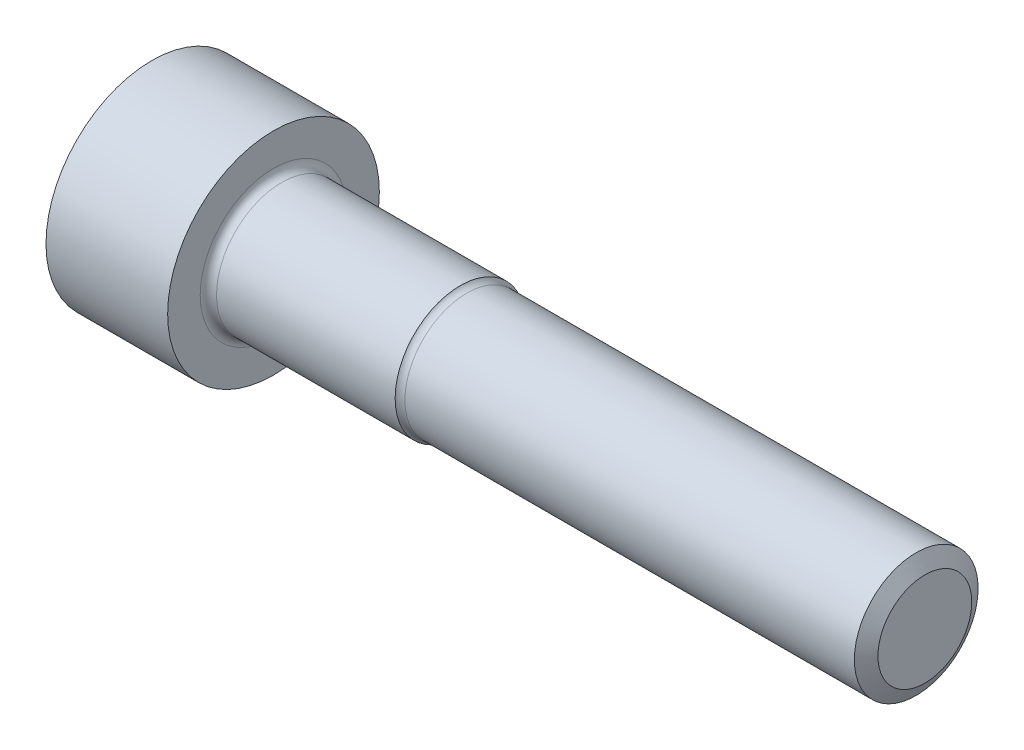
ISO-10303-21;
HEADER;
FILE_DESCRIPTION(('STEP AP214'),'2;1');
FILE_NAME('part.step','',(''),(''),'','','');
FILE_SCHEMA(('AUTOMOTIVE_DESIGN { 1 0 10303 214 1 1 1 1 }'));
ENDSEC;
DATA;
#1=APPLICATION_CONTEXT('core data for automotive mechanical design processes');
#2=APPLICATION_PROTOCOL_DEFINITION('international standard','automotive_design',2000,#1);
#3=PRODUCT_CONTEXT('',#1,'mechanical');
#4=PRODUCT('Part','Part','',(#3));
#5=PRODUCT_RELATED_PRODUCT_CATEGORY('part','',(#4));
#6=PRODUCT_DEFINITION_FORMATION('','',#4);
#7=PRODUCT_DEFINITION_CONTEXT('part definition',#1,'design');
#8=PRODUCT_DEFINITION('design','',#6,#7);
#9=PRODUCT_DEFINITION_SHAPE('','',#8);
#10=(LENGTH_UNIT() NAMED_UNIT(*) SI_UNIT(.MILLI.,.METRE.));
#11=(NAMED_UNIT(*) PLANE_ANGLE_UNIT() SI_UNIT($,.RADIAN.));
#12=(NAMED_UNIT(*) SI_UNIT($,.STERADIAN.) SOLID_ANGLE_UNIT());
#13=UNCERTAINTY_MEASURE_WITH_UNIT(LENGTH_MEASURE(1.E-05),#10,'distance_accuracy_value','');
#14=(GEOMETRIC_REPRESENTATION_CONTEXT(3) GLOBAL_UNCERTAINTY_ASSIGNED_CONTEXT((#13)) GLOBAL_UNIT_ASSIGNED_CONTEXT((#10,
#11,#12)) REPRESENTATION_CONTEXT('',''));
#15=CARTESIAN_POINT('',(0.,0.,0.));
#16=DIRECTION('',(0.,0.,1.));
#17=DIRECTION('',(1.,0.,0.));
#18=AXIS2_PLACEMENT_3D('',#15,#16,#17);
#19=CARTESIAN_POINT('',(0.,0.,0.));
#20=DIRECTION('',(1.,0.,0.));
#21=DIRECTION('',(0.,0.,-1.));
#22=AXIS2_PLACEMENT_3D('',#19,#20,#21);
#23=PLANE('',#22);
#24=DIRECTION('',(0.,0.5,0.866025403784439));
#25=VECTOR('',#24,1.);
#26=CARTESIAN_POINT('',(0.,-3.46410161513776,0.));
#27=LINE('',#26,#25);
#28=CARTESIAN_POINT('',(0.,-3.46410161513776,0.));
#29=VERTEX_POINT('',#28);
#30=CARTESIAN_POINT('',(0.,-1.73205080756888,3.));
#31=VERTEX_POINT('',#30);
#32=EDGE_CURVE('E251',#29,#31,#27,.T.);
#33=ORIENTED_EDGE('',*,*,#32,.F.);
#34=DIRECTION('',(0.,-0.5,0.866025403784439));
#35=VECTOR('',#34,1.);
#36=CARTESIAN_POINT('',(0.,-1.73205080756888,-3.));
#37=LINE('',#36,#35);
#38=CARTESIAN_POINT('',(0.,-1.73205080756888,-3.));
#39=VERTEX_POINT('',#38);
#40=EDGE_CURVE('E49',#39,#29,#37,.T.);
#41=ORIENTED_EDGE('',*,*,#40,.F.);
#42=DIRECTION('',(0.,-1.,0.));
#43=VECTOR('',#42,1.);
#44=CARTESIAN_POINT('',(0.,1.73205080756888,-3.));
#45=LINE('',#44,#43);
#46=CARTESIAN_POINT('',(0.,1.73205080756888,-3.));
#47=VERTEX_POINT('',#46);
#48=EDGE_CURVE('E84',#47,#39,#45,.T.);
#49=ORIENTED_EDGE('',*,*,#48,.F.);
#50=DIRECTION('',(0.,-0.5,-0.866025403784439));
#51=VECTOR('',#50,1.);
#52=CARTESIAN_POINT('',(0.,3.46410161513775,0.));
#53=LINE('',#52,#51);
#54=CARTESIAN_POINT('',(0.,3.46410161513775,0.));
#55=VERTEX_POINT('',#54);
#56=EDGE_CURVE('E93',#55,#47,#53,.T.);
#57=ORIENTED_EDGE('',*,*,#56,.F.);
#58=DIRECTION('',(0.,0.5,-0.866025403784439));
#59=VECTOR('',#58,1.);
#60=CARTESIAN_POINT('',(0.,1.73205080756888,3.));
#61=LINE('',#60,#59);
#62=CARTESIAN_POINT('',(0.,1.73205080756888,3.));
#63=VERTEX_POINT('',#62);
#64=EDGE_CURVE('E99',#63,#55,#61,.T.);
#65=ORIENTED_EDGE('',*,*,#64,.F.);
#66=DIRECTION('',(0.,1.,0.));
#67=VECTOR('',#66,1.);
#68=CARTESIAN_POINT('',(0.,-1.73205080756888,3.));
#69=LINE('',#68,#67);
#70=EDGE_CURVE('E266',#31,#63,#69,.T.);
#71=ORIENTED_EDGE('',*,*,#70,.F.);
#72=EDGE_LOOP('',(#33,#41,#49,#57,#65,#71));
#73=FACE_BOUND('',#72,.T.);
#74=CARTESIAN_POINT('',(0.,0.,0.));
#75=DIRECTION('',(-1.,0.,0.));
#76=DIRECTION('',(0.,0.,1.));
#77=AXIS2_PLACEMENT_3D('',#74,#75,#76);
#78=CIRCLE('',#77,5.5820130719885);
#79=CARTESIAN_POINT('',(0.,0.,5.5820130719885));
#80=VERTEX_POINT('',#79);
#81=EDGE_CURVE('E133',#80,#80,#78,.T.);
#82=ORIENTED_EDGE('',*,*,#81,.T.);
#83=EDGE_LOOP('',(#82));
#84=FACE_BOUND('',#83,.T.);
#85=ADVANCED_FACE('F34',(#73,#84),#23,.F.);
#86=CARTESIAN_POINT('',(0.530000000000001,0.,0.));
#87=DIRECTION('',(1.,0.,0.));
#88=DIRECTION('',(0.,0.,-1.));
#89=AXIS2_PLACEMENT_3D('',#86,#87,#88);
#90=CONICAL_SURFACE('',#89,6.5,1.04719755119659);
#91=ORIENTED_EDGE('',*,*,#81,.F.);
#92=EDGE_LOOP('',(#91));
#93=FACE_BOUND('',#92,.T.);
#94=CARTESIAN_POINT('',(0.530000000000001,0.,0.));
#95=DIRECTION('',(-1.,0.,0.));
#96=DIRECTION('',(0.,0.,1.));
#97=AXIS2_PLACEMENT_3D('',#94,#95,#96);
#98=CIRCLE('',#97,6.5);
#99=CARTESIAN_POINT('',(0.530000000000001,0.,6.5));
#100=VERTEX_POINT('',#99);
#101=EDGE_CURVE('E130',#100,#100,#98,.T.);
#102=ORIENTED_EDGE('',*,*,#101,.T.);
#103=EDGE_LOOP('',(#102));
#104=FACE_BOUND('',#103,.T.);
#105=ADVANCED_FACE('F154',(#93,#104),#90,.T.);
#106=CARTESIAN_POINT('',(0.,0.,0.));
#107=DIRECTION('',(-1.,0.,0.));
#108=DIRECTION('',(0.,0.,1.));
#109=AXIS2_PLACEMENT_3D('',#106,#107,#108);
#110=CYLINDRICAL_SURFACE('',#109,6.5);
#111=ORIENTED_EDGE('',*,*,#101,.F.);
#112=EDGE_LOOP('',(#111));
#113=FACE_BOUND('',#112,.T.);
#114=CARTESIAN_POINT('',(8.,0.,0.));
#115=DIRECTION('',(-1.,0.,0.));
#116=DIRECTION('',(0.,0.,1.));
#117=AXIS2_PLACEMENT_3D('',#114,#115,#116);
#118=CIRCLE('',#117,6.5);
#119=CARTESIAN_POINT('',(8.,0.,6.5));
#120=VERTEX_POINT('',#119);
#121=EDGE_CURVE('E127',#120,#120,#118,.T.);
#122=ORIENTED_EDGE('',*,*,#121,.T.);
#123=EDGE_LOOP('',(#122));
#124=FACE_BOUND('',#123,.T.);
#125=ADVANCED_FACE('F159',(#113,#124),#110,.T.);
#126=CARTESIAN_POINT('',(8.,6.5,0.));
#127=DIRECTION('',(-1.,0.,0.));
#128=DIRECTION('',(0.,0.,1.));
#129=AXIS2_PLACEMENT_3D('',#126,#127,#128);
#130=PLANE('',#129);
#131=CARTESIAN_POINT('',(8.,0.,0.));
#132=DIRECTION('',(-1.,0.,0.));
#133=DIRECTION('',(0.,0.,1.));
#134=AXIS2_PLACEMENT_3D('',#131,#132,#133);
#135=CIRCLE('',#134,4.5);
#136=CARTESIAN_POINT('',(8.,0.,4.5));
#137=VERTEX_POINT('',#136);
#138=EDGE_CURVE('E42',#137,#137,#135,.T.);
#139=ORIENTED_EDGE('',*,*,#138,.T.);
#140=EDGE_LOOP('',(#139));
#141=FACE_BOUND('',#140,.T.);
#142=ORIENTED_EDGE('',*,*,#121,.F.);
#143=EDGE_LOOP('',(#142));
#144=FACE_BOUND('',#143,.T.);
#145=ADVANCED_FACE('F141',(#141,#144),#130,.F.);
#146=CARTESIAN_POINT('',(0.,0.,0.));
#147=DIRECTION('',(-1.,0.,0.));
#148=DIRECTION('',(0.,0.,1.));
#149=AXIS2_PLACEMENT_3D('',#146,#147,#148);
#150=CYLINDRICAL_SURFACE('',#149,4.);
#151=CARTESIAN_POINT('',(8.5,0.,0.));
#152=DIRECTION('',(-1.,0.,0.));
#153=DIRECTION('',(0.,0.,1.));
#154=AXIS2_PLACEMENT_3D('',#151,#152,#153);
#155=CIRCLE('',#154,4.);
#156=CARTESIAN_POINT('',(8.5,0.,4.));
#157=VERTEX_POINT('',#156);
#158=EDGE_CURVE('E11',#157,#157,#155,.F.);
#159=ORIENTED_EDGE('',*,*,#158,.T.);
#160=EDGE_LOOP('',(#159));
#161=FACE_BOUND('',#160,.T.);
#162=CARTESIAN_POINT('',(19.47,0.,0.));
#163=DIRECTION('',(-1.,0.,0.));
#164=DIRECTION('',(0.,0.,1.));
#165=AXIS2_PLACEMENT_3D('',#162,#163,#164);
#166=CIRCLE('',#165,4.);
#167=CARTESIAN_POINT('',(19.47,0.,4.));
#168=VERTEX_POINT('',#167);
#169=EDGE_CURVE('E124',#168,#168,#166,.T.);
#170=ORIENTED_EDGE('',*,*,#169,.T.);
#171=EDGE_LOOP('',(#170));
#172=FACE_BOUND('',#171,.T.);
#173=ADVANCED_FACE('F168',(#161,#172),#150,.T.);
#174=CARTESIAN_POINT('',(0.,0.,0.));
#175=DIRECTION('',(-1.,0.,0.));
#176=DIRECTION('',(0.,0.,1.));
#177=AXIS2_PLACEMENT_3D('',#174,#175,#176);
#178=CYLINDRICAL_SURFACE('',#177,3.8);
#179=CARTESIAN_POINT('',(19.87,0.,0.));
#180=DIRECTION('',(-1.,0.,0.));
#181=DIRECTION('',(0.,0.,1.));
#182=AXIS2_PLACEMENT_3D('',#179,#180,#181);
#183=CIRCLE('',#182,3.8);
#184=CARTESIAN_POINT('',(19.87,0.,3.8));
#185=VERTEX_POINT('',#184);
#186=EDGE_CURVE('E136',#185,#185,#183,.F.);
#187=ORIENTED_EDGE('',*,*,#186,.T.);
#188=EDGE_LOOP('',(#187));
#189=FACE_BOUND('',#188,.T.);
#190=CARTESIAN_POINT('',(47.47,0.,0.));
#191=DIRECTION('',(-1.,0.,0.));
#192=DIRECTION('',(0.,0.,1.));
#193=AXIS2_PLACEMENT_3D('',#190,#191,#192);
#194=CIRCLE('',#193,3.8);
#195=CARTESIAN_POINT('',(47.47,0.,3.8));
#196=VERTEX_POINT('',#195);
#197=EDGE_CURVE('E121',#196,#196,#194,.T.);
#198=ORIENTED_EDGE('',*,*,#197,.T.);
#199=EDGE_LOOP('',(#198));
#200=FACE_BOUND('',#199,.T.);
#201=ADVANCED_FACE('F171',(#189,#200),#178,.T.);
#202=CARTESIAN_POINT('',(48.,0.,0.));
#203=DIRECTION('',(-1.,0.,0.));
#204=DIRECTION('',(0.,0.,1.));
#205=AXIS2_PLACEMENT_3D('',#202,#203,#204);
#206=CONICAL_SURFACE('',#205,2.88201307198849,1.0471975511966);
#207=ORIENTED_EDGE('',*,*,#197,.F.);
#208=EDGE_LOOP('',(#207));
#209=FACE_BOUND('',#208,.T.);
#210=CARTESIAN_POINT('',(48.,0.,0.));
#211=DIRECTION('',(-1.,0.,0.));
#212=DIRECTION('',(0.,0.,1.));
#213=AXIS2_PLACEMENT_3D('',#210,#211,#212);
#214=CIRCLE('',#213,2.88201307198849);
#215=CARTESIAN_POINT('',(48.,0.,2.88201307198849));
#216=VERTEX_POINT('',#215);
#217=EDGE_CURVE('E110',#216,#216,#214,.T.);
#218=ORIENTED_EDGE('',*,*,#217,.T.);
#219=EDGE_LOOP('',(#218));
#220=FACE_BOUND('',#219,.T.);
#221=ADVANCED_FACE('F175',(#209,#220),#206,.T.);
#222=CARTESIAN_POINT('',(48.,2.88201307198849,0.));
#223=DIRECTION('',(-1.,0.,0.));
#224=DIRECTION('',(0.,0.,1.));
#225=AXIS2_PLACEMENT_3D('',#222,#223,#224);
#226=PLANE('',#225);
#227=ORIENTED_EDGE('',*,*,#217,.F.);
#228=EDGE_LOOP('',(#227));
#229=FACE_BOUND('',#228,.T.);
#230=ADVANCED_FACE('F179',(#229),#226,.F.);
#231=CARTESIAN_POINT('',(4.,-1.73205080756888,-3.));
#232=DIRECTION('',(0.,-0.866025403784439,-0.5));
#233=DIRECTION('',(0.,0.5,-0.866025403784439));
#234=AXIS2_PLACEMENT_3D('',#231,#232,#233);
#235=PLANE('',#234);
#236=ORIENTED_EDGE('',*,*,#40,.T.);
#237=DIRECTION('',(-1.,0.,0.));
#238=VECTOR('',#237,1.);
#239=CARTESIAN_POINT('',(4.,-3.46410161513776,0.));
#240=LINE('',#239,#238);
#241=CARTESIAN_POINT('',(4.,-3.46410161513775,0.));
#242=VERTEX_POINT('',#241);
#243=EDGE_CURVE('E117',#242,#29,#240,.T.);
#244=ORIENTED_EDGE('',*,*,#243,.F.);
#245=DIRECTION('',(0.,-0.5,0.866025403784439));
#246=VECTOR('',#245,1.);
#247=CARTESIAN_POINT('',(4.,-1.73205080756888,-3.));
#248=LINE('',#247,#246);
#249=CARTESIAN_POINT('',(4.,-1.73205080756888,-3.));
#250=VERTEX_POINT('',#249);
#251=EDGE_CURVE('E103',#250,#242,#248,.T.);
#252=ORIENTED_EDGE('',*,*,#251,.F.);
#253=DIRECTION('',(-1.,0.,0.));
#254=VECTOR('',#253,1.);
#255=CARTESIAN_POINT('',(4.,-1.73205080756888,-3.));
#256=LINE('',#255,#254);
#257=EDGE_CURVE('E89',#250,#39,#256,.T.);
#258=ORIENTED_EDGE('',*,*,#257,.T.);
#259=EDGE_LOOP('',(#236,#244,#252,#258));
#260=FACE_BOUND('',#259,.T.);
#261=ADVANCED_FACE('F183',(#260),#235,.F.);
#262=CARTESIAN_POINT('',(4.,1.73205080756888,-3.));
#263=DIRECTION('',(0.,0.,-1.));
#264=DIRECTION('',(-1.,0.,0.));
#265=AXIS2_PLACEMENT_3D('',#262,#263,#264);
#266=PLANE('',#265);
#267=ORIENTED_EDGE('',*,*,#48,.T.);
#268=ORIENTED_EDGE('',*,*,#257,.F.);
#269=DIRECTION('',(0.,-1.,0.));
#270=VECTOR('',#269,1.);
#271=CARTESIAN_POINT('',(4.,1.73205080756888,-3.));
#272=LINE('',#271,#270);
#273=CARTESIAN_POINT('',(4.,1.73205080756888,-3.));
#274=VERTEX_POINT('',#273);
#275=EDGE_CURVE('E86',#274,#250,#272,.T.);
#276=ORIENTED_EDGE('',*,*,#275,.F.);
#277=DIRECTION('',(-1.,0.,0.));
#278=VECTOR('',#277,1.);
#279=CARTESIAN_POINT('',(4.,1.73205080756888,-3.));
#280=LINE('',#279,#278);
#281=EDGE_CURVE('E79',#274,#47,#280,.T.);
#282=ORIENTED_EDGE('',*,*,#281,.T.);
#283=EDGE_LOOP('',(#267,#268,#276,#282));
#284=FACE_BOUND('',#283,.T.);
#285=ADVANCED_FACE('F81',(#284),#266,.F.);
#286=CARTESIAN_POINT('',(4.,3.46410161513775,0.));
#287=DIRECTION('',(0.,0.866025403784439,-0.5));
#288=DIRECTION('',(0.,0.5,0.866025403784439));
#289=AXIS2_PLACEMENT_3D('',#286,#287,#288);
#290=PLANE('',#289);
#291=ORIENTED_EDGE('',*,*,#56,.T.);
#292=ORIENTED_EDGE('',*,*,#281,.F.);
#293=DIRECTION('',(0.,-0.5,-0.866025403784439));
#294=VECTOR('',#293,1.);
#295=CARTESIAN_POINT('',(4.,3.46410161513775,0.));
#296=LINE('',#295,#294);
#297=CARTESIAN_POINT('',(4.,3.46410161513775,0.));
#298=VERTEX_POINT('',#297);
#299=EDGE_CURVE('E258',#298,#274,#296,.T.);
#300=ORIENTED_EDGE('',*,*,#299,.F.);
#301=DIRECTION('',(-1.,0.,0.));
#302=VECTOR('',#301,1.);
#303=CARTESIAN_POINT('',(4.,3.46410161513775,0.));
#304=LINE('',#303,#302);
#305=EDGE_CURVE('E90',#298,#55,#304,.T.);
#306=ORIENTED_EDGE('',*,*,#305,.T.);
#307=EDGE_LOOP('',(#291,#292,#300,#306));
#308=FACE_BOUND('',#307,.T.);
#309=ADVANCED_FACE('F94',(#308),#290,.F.);
#310=CARTESIAN_POINT('',(4.,1.73205080756888,3.));
#311=DIRECTION('',(0.,0.866025403784439,0.5));
#312=DIRECTION('',(0.,-0.5,0.866025403784439));
#313=AXIS2_PLACEMENT_3D('',#310,#311,#312);
#314=PLANE('',#313);
#315=ORIENTED_EDGE('',*,*,#64,.T.);
#316=ORIENTED_EDGE('',*,*,#305,.F.);
#317=DIRECTION('',(0.,0.5,-0.866025403784439));
#318=VECTOR('',#317,1.);
#319=CARTESIAN_POINT('',(4.,1.73205080756888,3.));
#320=LINE('',#319,#318);
#321=CARTESIAN_POINT('',(4.,1.73205080756888,3.));
#322=VERTEX_POINT('',#321);
#323=EDGE_CURVE('E256',#322,#298,#320,.T.);
#324=ORIENTED_EDGE('',*,*,#323,.F.);
#325=DIRECTION('',(-1.,0.,0.));
#326=VECTOR('',#325,1.);
#327=CARTESIAN_POINT('',(4.,1.73205080756888,3.));
#328=LINE('',#327,#326);
#329=EDGE_CURVE('E113',#322,#63,#328,.T.);
#330=ORIENTED_EDGE('',*,*,#329,.T.);
#331=EDGE_LOOP('',(#315,#316,#324,#330));
#332=FACE_BOUND('',#331,.T.);
#333=ADVANCED_FACE('F195',(#332),#314,.F.);
#334=CARTESIAN_POINT('',(4.,-1.73205080756888,3.));
#335=DIRECTION('',(0.,0.,1.));
#336=DIRECTION('',(0.,-1.,0.));
#337=AXIS2_PLACEMENT_3D('',#334,#335,#336);
#338=PLANE('',#337);
#339=ORIENTED_EDGE('',*,*,#70,.T.);
#340=ORIENTED_EDGE('',*,*,#329,.F.);
#341=DIRECTION('',(0.,1.,0.));
#342=VECTOR('',#341,1.);
#343=CARTESIAN_POINT('',(4.,-1.73205080756888,3.));
#344=LINE('',#343,#342);
#345=CARTESIAN_POINT('',(4.,-1.73205080756888,3.));
#346=VERTEX_POINT('',#345);
#347=EDGE_CURVE('E242',#346,#322,#344,.T.);
#348=ORIENTED_EDGE('',*,*,#347,.F.);
#349=DIRECTION('',(-1.,0.,0.));
#350=VECTOR('',#349,1.);
#351=CARTESIAN_POINT('',(4.,-1.73205080756888,3.));
#352=LINE('',#351,#350);
#353=EDGE_CURVE('E115',#346,#31,#352,.T.);
#354=ORIENTED_EDGE('',*,*,#353,.T.);
#355=EDGE_LOOP('',(#339,#340,#348,#354));
#356=FACE_BOUND('',#355,.T.);
#357=ADVANCED_FACE('F191',(#356),#338,.F.);
#358=CARTESIAN_POINT('',(4.,-3.46410161513776,0.));
#359=DIRECTION('',(0.,-0.866025403784439,0.5));
#360=DIRECTION('',(0.,-0.5,-0.866025403784439));
#361=AXIS2_PLACEMENT_3D('',#358,#359,#360);
#362=PLANE('',#361);
#363=ORIENTED_EDGE('',*,*,#32,.T.);
#364=ORIENTED_EDGE('',*,*,#353,.F.);
#365=DIRECTION('',(0.,0.5,0.866025403784439));
#366=VECTOR('',#365,1.);
#367=CARTESIAN_POINT('',(4.,-3.46410161513776,0.));
#368=LINE('',#367,#366);
#369=EDGE_CURVE('E106',#242,#346,#368,.T.);
#370=ORIENTED_EDGE('',*,*,#369,.F.);
#371=ORIENTED_EDGE('',*,*,#243,.T.);
#372=EDGE_LOOP('',(#363,#364,#370,#371));
#373=FACE_BOUND('',#372,.T.);
#374=ADVANCED_FACE('F187',(#373),#362,.F.);
#375=CARTESIAN_POINT('',(4.,0.,0.));
#376=DIRECTION('',(1.,0.,0.));
#377=DIRECTION('',(0.,0.,-1.));
#378=AXIS2_PLACEMENT_3D('',#375,#376,#377);
#379=PLANE('',#378);
#380=ORIENTED_EDGE('',*,*,#251,.T.);
#381=CARTESIAN_POINT('',(4.,0.,0.));
#382=DIRECTION('',(-1.,0.,0.));
#383=DIRECTION('',(0.,0.,1.));
#384=AXIS2_PLACEMENT_3D('',#381,#382,#383);
#385=CIRCLE('',#384,3.46410161513775);
#386=EDGE_CURVE('E249',#250,#242,#385,.T.);
#387=ORIENTED_EDGE('',*,*,#386,.F.);
#388=EDGE_LOOP('',(#380,#387));
#389=FACE_BOUND('',#388,.T.);
#390=ADVANCED_FACE('F190',(#389),#379,.T.);
#391=ORIENTED_EDGE('',*,*,#369,.T.);
#392=EDGE_CURVE('E239',#242,#346,#385,.T.);
#393=ORIENTED_EDGE('',*,*,#392,.F.);
#394=EDGE_LOOP('',(#391,#393));
#395=FACE_BOUND('',#394,.T.);
#396=ADVANCED_FACE('F206',(#395),#379,.T.);
#397=ORIENTED_EDGE('',*,*,#347,.T.);
#398=EDGE_CURVE('E245',#346,#322,#385,.T.);
#399=ORIENTED_EDGE('',*,*,#398,.F.);
#400=EDGE_LOOP('',(#397,#399));
#401=FACE_BOUND('',#400,.T.);
#402=ADVANCED_FACE('F246',(#401),#379,.T.);
#403=ORIENTED_EDGE('',*,*,#323,.T.);
#404=EDGE_CURVE('E219',#322,#298,#385,.T.);
#405=ORIENTED_EDGE('',*,*,#404,.F.);
#406=EDGE_LOOP('',(#403,#405));
#407=FACE_BOUND('',#406,.T.);
#408=ADVANCED_FACE('F268',(#407),#379,.T.);
#409=ORIENTED_EDGE('',*,*,#299,.T.);
#410=EDGE_CURVE('E58',#298,#274,#385,.T.);
#411=ORIENTED_EDGE('',*,*,#410,.F.);
#412=EDGE_LOOP('',(#409,#411));
#413=FACE_BOUND('',#412,.T.);
#414=ADVANCED_FACE('F213',(#413),#379,.T.);
#415=ORIENTED_EDGE('',*,*,#275,.T.);
#416=EDGE_CURVE('E270',#274,#250,#385,.T.);
#417=ORIENTED_EDGE('',*,*,#416,.F.);
#418=EDGE_LOOP('',(#415,#417));
#419=FACE_BOUND('',#418,.T.);
#420=ADVANCED_FACE('F208',(#419),#379,.T.);
#421=CARTESIAN_POINT('',(5.61533711176581,0.,0.));
#422=DIRECTION('',(-1.,0.,0.));
#423=DIRECTION('',(0.,0.,1.));
#424=AXIS2_PLACEMENT_3D('',#421,#422,#423);
#425=CONICAL_SURFACE('',#424,0.,1.13446401379632);
#426=ORIENTED_EDGE('',*,*,#404,.T.);
#427=ORIENTED_EDGE('',*,*,#410,.T.);
#428=ORIENTED_EDGE('',*,*,#416,.T.);
#429=ORIENTED_EDGE('',*,*,#386,.T.);
#430=ORIENTED_EDGE('',*,*,#392,.T.);
#431=ORIENTED_EDGE('',*,*,#398,.T.);
#432=EDGE_LOOP('',(#426,#427,#428,#429,#430,#431));
#433=FACE_BOUND('',#432,.T.);
#434=CARTESIAN_POINT('',(5.61533711176581,0.,0.));
#435=VERTEX_POINT('',#434);
#436=VERTEX_LOOP('',#435);
#437=FACE_BOUND('',#436,.T.);
#438=ADVANCED_FACE('F150',(#433,#437),#425,.F.);
#439=CARTESIAN_POINT('',(19.87,0.,0.));
#440=DIRECTION('',(-1.,0.,0.));
#441=DIRECTION('',(0.,0.,1.));
#442=AXIS2_PLACEMENT_3D('',#439,#440,#441);
#443=TOROIDAL_SURFACE('',#442,4.3,0.5);
#444=ORIENTED_EDGE('',*,*,#186,.F.);
#445=EDGE_LOOP('',(#444));
#446=FACE_BOUND('',#445,.T.);
#447=ORIENTED_EDGE('',*,*,#169,.F.);
#448=EDGE_LOOP('',(#447));
#449=FACE_BOUND('',#448,.T.);
#450=ADVANCED_FACE('F145',(#446,#449),#443,.F.);
#451=CARTESIAN_POINT('',(8.5,0.,0.));
#452=DIRECTION('',(-1.,0.,0.));
#453=DIRECTION('',(0.,0.,1.));
#454=AXIS2_PLACEMENT_3D('',#451,#452,#453);
#455=TOROIDAL_SURFACE('',#454,4.5,0.5);
#456=ORIENTED_EDGE('',*,*,#158,.F.);
#457=EDGE_LOOP('',(#456));
#458=FACE_BOUND('',#457,.T.);
#459=ORIENTED_EDGE('',*,*,#138,.F.);
#460=EDGE_LOOP('',(#459));
#461=FACE_BOUND('',#460,.T.);
#462=ADVANCED_FACE('F36',(#458,#461),#455,.F.);
#463=CLOSED_SHELL('',(#85,#105,#125,#145,#173,#201,#221,#230,#261,#285,#309,#333,#357,#374,#390,
#396,#402,#408,#414,#420,#438,#450,#462));
#464=MANIFOLD_SOLID_BREP('B2',#463);
#465=ADVANCED_BREP_SHAPE_REPRESENTATION('',(#18,#464),#14);
#466=SHAPE_DEFINITION_REPRESENTATION(#9,#465);
ENDSEC;
END-ISO-10303-21;
